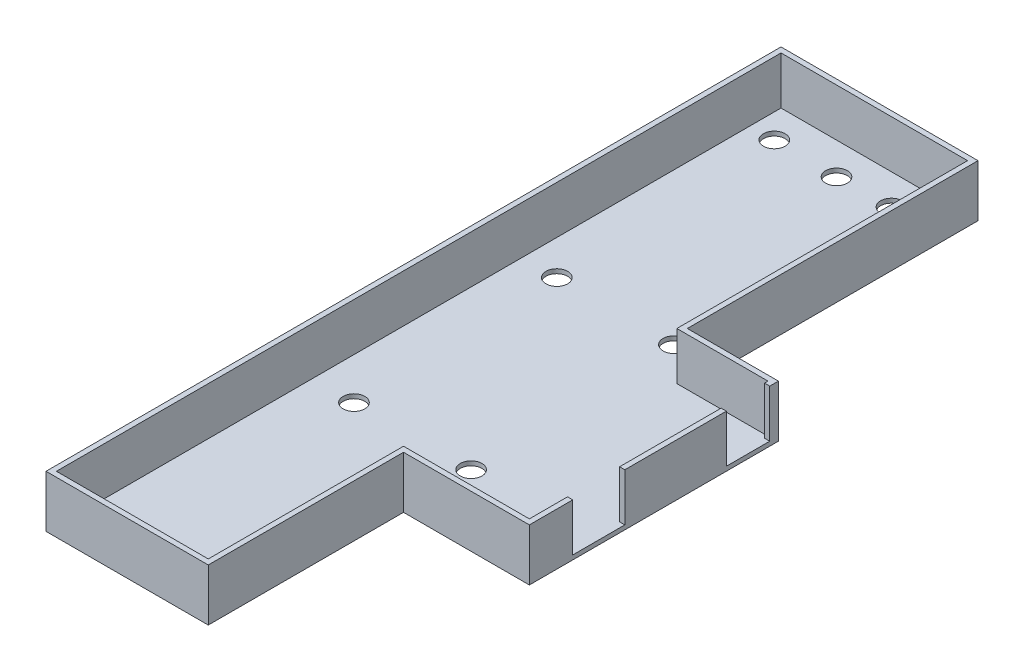
ISO-10303-21;
HEADER;
FILE_DESCRIPTION(('STEP AP214'),'2;1');
FILE_NAME('part.step','',(''),(''),'','','');
FILE_SCHEMA(('AUTOMOTIVE_DESIGN { 1 0 10303 214 1 1 1 1 }'));
ENDSEC;
DATA;
#1=APPLICATION_CONTEXT('core data for automotive mechanical design processes');
#2=APPLICATION_PROTOCOL_DEFINITION('international standard','automotive_design',2000,#1);
#3=PRODUCT_CONTEXT('',#1,'mechanical');
#4=PRODUCT('Part','Part','',(#3));
#5=PRODUCT_RELATED_PRODUCT_CATEGORY('part','',(#4));
#6=PRODUCT_DEFINITION_FORMATION('','',#4);
#7=PRODUCT_DEFINITION_CONTEXT('part definition',#1,'design');
#8=PRODUCT_DEFINITION('design','',#6,#7);
#9=PRODUCT_DEFINITION_SHAPE('','',#8);
#10=(LENGTH_UNIT() NAMED_UNIT(*) SI_UNIT(.MILLI.,.METRE.));
#11=(NAMED_UNIT(*) PLANE_ANGLE_UNIT() SI_UNIT($,.RADIAN.));
#12=(NAMED_UNIT(*) SI_UNIT($,.STERADIAN.) SOLID_ANGLE_UNIT());
#13=UNCERTAINTY_MEASURE_WITH_UNIT(LENGTH_MEASURE(1.E-05),#10,'distance_accuracy_value','');
#14=(GEOMETRIC_REPRESENTATION_CONTEXT(3) GLOBAL_UNCERTAINTY_ASSIGNED_CONTEXT((#13)) GLOBAL_UNIT_ASSIGNED_CONTEXT((#10,
#11,#12)) REPRESENTATION_CONTEXT('',''));
#15=CARTESIAN_POINT('',(0.,0.,0.));
#16=DIRECTION('',(0.,0.,1.));
#17=DIRECTION('',(1.,0.,0.));
#18=AXIS2_PLACEMENT_3D('',#15,#16,#17);
#19=CARTESIAN_POINT('',(64.,12.,67.));
#20=DIRECTION('',(-1.,0.,0.));
#21=DIRECTION('',(0.,0.,1.));
#22=AXIS2_PLACEMENT_3D('',#19,#20,#21);
#23=PLANE('',#22);
#24=DIRECTION('',(0.,1.,0.));
#25=VECTOR('',#24,1.);
#26=CARTESIAN_POINT('',(64.,12.,113.2));
#27=LINE('',#26,#25);
#28=CARTESIAN_POINT('',(64.,1.,113.2));
#29=VERTEX_POINT('',#28);
#30=CARTESIAN_POINT('',(64.,12.,113.2));
#31=VERTEX_POINT('',#30);
#32=EDGE_CURVE('E228',#29,#31,#27,.T.);
#33=ORIENTED_EDGE('',*,*,#32,.F.);
#34=DIRECTION('',(0.,0.,1.));
#35=VECTOR('',#34,1.);
#36=CARTESIAN_POINT('',(64.,1.,0.));
#37=LINE('',#36,#35);
#38=CARTESIAN_POINT('',(64.,1.,122.));
#39=VERTEX_POINT('',#38);
#40=EDGE_CURVE('E201',#29,#39,#37,.T.);
#41=ORIENTED_EDGE('',*,*,#40,.T.);
#42=DIRECTION('',(0.,-1.,0.));
#43=VECTOR('',#42,1.);
#44=CARTESIAN_POINT('',(64.,12.,122.));
#45=LINE('',#44,#43);
#46=CARTESIAN_POINT('',(64.,12.,122.));
#47=VERTEX_POINT('',#46);
#48=EDGE_CURVE('E280',#47,#39,#45,.T.);
#49=ORIENTED_EDGE('',*,*,#48,.F.);
#50=DIRECTION('',(0.,0.,-1.));
#51=VECTOR('',#50,1.);
#52=CARTESIAN_POINT('',(64.,12.,67.));
#53=LINE('',#52,#51);
#54=EDGE_CURVE('E262',#47,#31,#53,.T.);
#55=ORIENTED_EDGE('',*,*,#54,.T.);
#56=EDGE_LOOP('',(#33,#41,#49,#55));
#57=FACE_BOUND('',#56,.T.);
#58=ADVANCED_FACE('F35',(#57),#23,.T.);
#59=CARTESIAN_POINT('',(0.,12.,0.));
#60=DIRECTION('',(0.,-1.,0.));
#61=DIRECTION('',(0.,0.,-1.));
#62=AXIS2_PLACEMENT_3D('',#59,#60,#61);
#63=PLANE('',#62);
#64=DIRECTION('',(0.,0.,-1.));
#65=VECTOR('',#64,1.);
#66=CARTESIAN_POINT('',(65.2,12.,65.8));
#67=LINE('',#66,#65);
#68=CARTESIAN_POINT('',(65.2,12.,123.2));
#69=VERTEX_POINT('',#68);
#70=CARTESIAN_POINT('',(65.2,12.,113.2));
#71=VERTEX_POINT('',#70);
#72=EDGE_CURVE('E311',#69,#71,#67,.T.);
#73=ORIENTED_EDGE('',*,*,#72,.T.);
#74=DIRECTION('',(1.,0.,0.));
#75=VECTOR('',#74,1.);
#76=CARTESIAN_POINT('',(53.2,12.,113.2));
#77=LINE('',#76,#75);
#78=EDGE_CURVE('E210',#31,#71,#77,.T.);
#79=ORIENTED_EDGE('',*,*,#78,.F.);
#80=ORIENTED_EDGE('',*,*,#54,.F.);
#81=DIRECTION('',(1.,0.,0.));
#82=VECTOR('',#81,1.);
#83=CARTESIAN_POINT('',(64.,12.,122.));
#84=LINE('',#83,#82);
#85=CARTESIAN_POINT('',(35.,12.,122.));
#86=VERTEX_POINT('',#85);
#87=EDGE_CURVE('E259',#86,#47,#84,.T.);
#88=ORIENTED_EDGE('',*,*,#87,.F.);
#89=DIRECTION('',(0.,0.,-1.));
#90=VECTOR('',#89,1.);
#91=CARTESIAN_POINT('',(35.,12.,122.));
#92=LINE('',#91,#90);
#93=CARTESIAN_POINT('',(35.,12.,167.));
#94=VERTEX_POINT('',#93);
#95=EDGE_CURVE('E257',#94,#86,#92,.T.);
#96=ORIENTED_EDGE('',*,*,#95,.F.);
#97=DIRECTION('',(1.,0.,0.));
#98=VECTOR('',#97,1.);
#99=CARTESIAN_POINT('',(0.,12.,167.));
#100=LINE('',#99,#98);
#101=CARTESIAN_POINT('',(0.,12.,167.));
#102=VERTEX_POINT('',#101);
#103=EDGE_CURVE('E255',#102,#94,#100,.T.);
#104=ORIENTED_EDGE('',*,*,#103,.F.);
#105=DIRECTION('',(0.,0.,1.));
#106=VECTOR('',#105,1.);
#107=CARTESIAN_POINT('',(0.,12.,0.));
#108=LINE('',#107,#106);
#109=CARTESIAN_POINT('',(0.,12.,0.));
#110=VERTEX_POINT('',#109);
#111=EDGE_CURVE('E253',#110,#102,#108,.T.);
#112=ORIENTED_EDGE('',*,*,#111,.F.);
#113=DIRECTION('',(-1.,0.,0.));
#114=VECTOR('',#113,1.);
#115=CARTESIAN_POINT('',(0.,12.,0.));
#116=LINE('',#115,#114);
#117=CARTESIAN_POINT('',(43.,12.,0.));
#118=VERTEX_POINT('',#117);
#119=EDGE_CURVE('E251',#118,#110,#116,.T.);
#120=ORIENTED_EDGE('',*,*,#119,.F.);
#121=DIRECTION('',(0.,0.,-1.));
#122=VECTOR('',#121,1.);
#123=CARTESIAN_POINT('',(43.,12.,0.));
#124=LINE('',#123,#122);
#125=CARTESIAN_POINT('',(43.,12.,67.));
#126=VERTEX_POINT('',#125);
#127=EDGE_CURVE('E269',#126,#118,#124,.T.);
#128=ORIENTED_EDGE('',*,*,#127,.F.);
#129=DIRECTION('',(-1.,0.,0.));
#130=VECTOR('',#129,1.);
#131=CARTESIAN_POINT('',(43.,12.,67.));
#132=LINE('',#131,#130);
#133=CARTESIAN_POINT('',(64.,12.,67.));
#134=VERTEX_POINT('',#133);
#135=EDGE_CURVE('E265',#134,#126,#132,.T.);
#136=ORIENTED_EDGE('',*,*,#135,.F.);
#137=CARTESIAN_POINT('',(64.,12.,67.8));
#138=VERTEX_POINT('',#137);
#139=EDGE_CURVE('E261',#138,#134,#53,.T.);
#140=ORIENTED_EDGE('',*,*,#139,.F.);
#141=DIRECTION('',(1.,0.,0.));
#142=VECTOR('',#141,1.);
#143=CARTESIAN_POINT('',(53.2,12.,67.8));
#144=LINE('',#143,#142);
#145=CARTESIAN_POINT('',(65.2,12.,67.8));
#146=VERTEX_POINT('',#145);
#147=EDGE_CURVE('E242',#138,#146,#144,.T.);
#148=ORIENTED_EDGE('',*,*,#147,.T.);
#149=CARTESIAN_POINT('',(65.2,12.,65.8));
#150=VERTEX_POINT('',#149);
#151=EDGE_CURVE('E310',#146,#150,#67,.T.);
#152=ORIENTED_EDGE('',*,*,#151,.T.);
#153=DIRECTION('',(-1.,0.,0.));
#154=VECTOR('',#153,1.);
#155=CARTESIAN_POINT('',(44.2,12.,65.8));
#156=LINE('',#155,#154);
#157=CARTESIAN_POINT('',(44.2,12.,65.8));
#158=VERTEX_POINT('',#157);
#159=EDGE_CURVE('E313',#150,#158,#156,.T.);
#160=ORIENTED_EDGE('',*,*,#159,.T.);
#161=DIRECTION('',(0.,0.,-1.));
#162=VECTOR('',#161,1.);
#163=CARTESIAN_POINT('',(44.2,12.,-1.2));
#164=LINE('',#163,#162);
#165=CARTESIAN_POINT('',(44.2,12.,-1.2));
#166=VERTEX_POINT('',#165);
#167=EDGE_CURVE('E317',#158,#166,#164,.T.);
#168=ORIENTED_EDGE('',*,*,#167,.T.);
#169=DIRECTION('',(-1.,0.,0.));
#170=VECTOR('',#169,1.);
#171=CARTESIAN_POINT('',(-1.2,12.,-1.2));
#172=LINE('',#171,#170);
#173=CARTESIAN_POINT('',(-1.2,12.,-1.2));
#174=VERTEX_POINT('',#173);
#175=EDGE_CURVE('E295',#166,#174,#172,.T.);
#176=ORIENTED_EDGE('',*,*,#175,.T.);
#177=DIRECTION('',(0.,0.,1.));
#178=VECTOR('',#177,1.);
#179=CARTESIAN_POINT('',(-1.2,12.,-1.2));
#180=LINE('',#179,#178);
#181=CARTESIAN_POINT('',(-1.2,12.,168.2));
#182=VERTEX_POINT('',#181);
#183=EDGE_CURVE('E298',#174,#182,#180,.T.);
#184=ORIENTED_EDGE('',*,*,#183,.T.);
#185=DIRECTION('',(1.,0.,0.));
#186=VECTOR('',#185,1.);
#187=CARTESIAN_POINT('',(-1.2,12.,168.2));
#188=LINE('',#187,#186);
#189=CARTESIAN_POINT('',(36.2,12.,168.2));
#190=VERTEX_POINT('',#189);
#191=EDGE_CURVE('E301',#182,#190,#188,.T.);
#192=ORIENTED_EDGE('',*,*,#191,.T.);
#193=DIRECTION('',(0.,0.,-1.));
#194=VECTOR('',#193,1.);
#195=CARTESIAN_POINT('',(36.2,12.,123.2));
#196=LINE('',#195,#194);
#197=CARTESIAN_POINT('',(36.2,12.,123.2));
#198=VERTEX_POINT('',#197);
#199=EDGE_CURVE('E304',#190,#198,#196,.T.);
#200=ORIENTED_EDGE('',*,*,#199,.T.);
#201=DIRECTION('',(1.,0.,0.));
#202=VECTOR('',#201,1.);
#203=CARTESIAN_POINT('',(65.2,12.,123.2));
#204=LINE('',#203,#202);
#205=EDGE_CURVE('E307',#198,#69,#204,.T.);
#206=ORIENTED_EDGE('',*,*,#205,.T.);
#207=EDGE_LOOP('',(#73,#79,#80,#88,#96,#104,#112,#120,#128,#136,#140,#148,#152,#160,#168,#176,
#184,#192,#200,#206));
#208=FACE_BOUND('',#207,.T.);
#209=ADVANCED_FACE('F396',(#208),#63,.F.);
#210=DIRECTION('',(0.,-1.,0.));
#211=VECTOR('',#210,1.);
#212=CARTESIAN_POINT('',(64.,12.,101.2));
#213=LINE('',#212,#211);
#214=CARTESIAN_POINT('',(64.,12.,101.2));
#215=VERTEX_POINT('',#214);
#216=CARTESIAN_POINT('',(64.,1.,101.2));
#217=VERTEX_POINT('',#216);
#218=EDGE_CURVE('E223',#215,#217,#213,.T.);
#219=ORIENTED_EDGE('',*,*,#218,.F.);
#220=CARTESIAN_POINT('',(64.,12.,77.8));
#221=VERTEX_POINT('',#220);
#222=EDGE_CURVE('E266',#215,#221,#53,.T.);
#223=ORIENTED_EDGE('',*,*,#222,.T.);
#224=DIRECTION('',(0.,1.,0.));
#225=VECTOR('',#224,1.);
#226=CARTESIAN_POINT('',(64.,12.,77.8));
#227=LINE('',#226,#225);
#228=CARTESIAN_POINT('',(64.,1.,77.8));
#229=VERTEX_POINT('',#228);
#230=EDGE_CURVE('E248',#229,#221,#227,.T.);
#231=ORIENTED_EDGE('',*,*,#230,.F.);
#232=EDGE_CURVE('E330',#229,#217,#37,.T.);
#233=ORIENTED_EDGE('',*,*,#232,.T.);
#234=EDGE_LOOP('',(#219,#223,#231,#233));
#235=FACE_BOUND('',#234,.T.);
#236=ADVANCED_FACE('F451',(#235),#23,.T.);
#237=CARTESIAN_POINT('',(0.,1.,-1.2));
#238=DIRECTION('',(0.,0.,-1.));
#239=DIRECTION('',(-1.,0.,0.));
#240=AXIS2_PLACEMENT_3D('',#237,#238,#239);
#241=PLANE('',#240);
#242=DIRECTION('',(1.,0.,0.));
#243=VECTOR('',#242,1.);
#244=CARTESIAN_POINT('',(0.,0.,-1.2));
#245=LINE('',#244,#243);
#246=CARTESIAN_POINT('',(-1.2,0.,-1.2));
#247=VERTEX_POINT('',#246);
#248=CARTESIAN_POINT('',(44.2,0.,-1.2));
#249=VERTEX_POINT('',#248);
#250=EDGE_CURVE('E345',#247,#249,#245,.T.);
#251=ORIENTED_EDGE('',*,*,#250,.F.);
#252=DIRECTION('',(0.,-1.,0.));
#253=VECTOR('',#252,1.);
#254=CARTESIAN_POINT('',(-1.2,1.,-1.2));
#255=LINE('',#254,#253);
#256=EDGE_CURVE('E11',#174,#247,#255,.T.);
#257=ORIENTED_EDGE('',*,*,#256,.F.);
#258=ORIENTED_EDGE('',*,*,#175,.F.);
#259=DIRECTION('',(0.,-1.,0.));
#260=VECTOR('',#259,1.);
#261=CARTESIAN_POINT('',(44.2,1.,-1.2));
#262=LINE('',#261,#260);
#263=EDGE_CURVE('E368',#166,#249,#262,.T.);
#264=ORIENTED_EDGE('',*,*,#263,.T.);
#265=EDGE_LOOP('',(#251,#257,#258,#264));
#266=FACE_BOUND('',#265,.T.);
#267=ADVANCED_FACE('F37',(#266),#241,.T.);
#268=CARTESIAN_POINT('',(-1.2,1.,0.));
#269=DIRECTION('',(1.,0.,0.));
#270=DIRECTION('',(0.,0.,-1.));
#271=AXIS2_PLACEMENT_3D('',#268,#269,#270);
#272=PLANE('',#271);
#273=DIRECTION('',(0.,0.,1.));
#274=VECTOR('',#273,1.);
#275=CARTESIAN_POINT('',(-1.2,0.,0.));
#276=LINE('',#275,#274);
#277=CARTESIAN_POINT('',(-1.2,0.,168.2));
#278=VERTEX_POINT('',#277);
#279=EDGE_CURVE('E348',#247,#278,#276,.T.);
#280=ORIENTED_EDGE('',*,*,#279,.T.);
#281=DIRECTION('',(0.,-1.,0.));
#282=VECTOR('',#281,1.);
#283=CARTESIAN_POINT('',(-1.2,1.,168.2));
#284=LINE('',#283,#282);
#285=EDGE_CURVE('E43',#182,#278,#284,.T.);
#286=ORIENTED_EDGE('',*,*,#285,.F.);
#287=ORIENTED_EDGE('',*,*,#183,.F.);
#288=ORIENTED_EDGE('',*,*,#256,.T.);
#289=EDGE_LOOP('',(#280,#286,#287,#288));
#290=FACE_BOUND('',#289,.T.);
#291=ADVANCED_FACE('F399',(#290),#272,.F.);
#292=CARTESIAN_POINT('',(0.,1.,168.2));
#293=DIRECTION('',(0.,0.,-1.));
#294=DIRECTION('',(-1.,0.,0.));
#295=AXIS2_PLACEMENT_3D('',#292,#293,#294);
#296=PLANE('',#295);
#297=DIRECTION('',(1.,0.,0.));
#298=VECTOR('',#297,1.);
#299=CARTESIAN_POINT('',(0.,0.,168.2));
#300=LINE('',#299,#298);
#301=CARTESIAN_POINT('',(36.2,0.,168.2));
#302=VERTEX_POINT('',#301);
#303=EDGE_CURVE('E350',#278,#302,#300,.T.);
#304=ORIENTED_EDGE('',*,*,#303,.T.);
#305=DIRECTION('',(0.,-1.,0.));
#306=VECTOR('',#305,1.);
#307=CARTESIAN_POINT('',(36.2,1.,168.2));
#308=LINE('',#307,#306);
#309=EDGE_CURVE('E378',#190,#302,#308,.T.);
#310=ORIENTED_EDGE('',*,*,#309,.F.);
#311=ORIENTED_EDGE('',*,*,#191,.F.);
#312=ORIENTED_EDGE('',*,*,#285,.T.);
#313=EDGE_LOOP('',(#304,#310,#311,#312));
#314=FACE_BOUND('',#313,.T.);
#315=ADVANCED_FACE('F383',(#314),#296,.F.);
#316=CARTESIAN_POINT('',(36.2,1.,0.));
#317=DIRECTION('',(1.,0.,0.));
#318=DIRECTION('',(0.,0.,-1.));
#319=AXIS2_PLACEMENT_3D('',#316,#317,#318);
#320=PLANE('',#319);
#321=DIRECTION('',(0.,0.,1.));
#322=VECTOR('',#321,1.);
#323=CARTESIAN_POINT('',(36.2,0.,0.));
#324=LINE('',#323,#322);
#325=CARTESIAN_POINT('',(36.2,0.,123.2));
#326=VERTEX_POINT('',#325);
#327=EDGE_CURVE('E353',#326,#302,#324,.T.);
#328=ORIENTED_EDGE('',*,*,#327,.F.);
#329=DIRECTION('',(0.,-1.,0.));
#330=VECTOR('',#329,1.);
#331=CARTESIAN_POINT('',(36.2,1.,123.2));
#332=LINE('',#331,#330);
#333=EDGE_CURVE('E376',#198,#326,#332,.T.);
#334=ORIENTED_EDGE('',*,*,#333,.F.);
#335=ORIENTED_EDGE('',*,*,#199,.F.);
#336=ORIENTED_EDGE('',*,*,#309,.T.);
#337=EDGE_LOOP('',(#328,#334,#335,#336));
#338=FACE_BOUND('',#337,.T.);
#339=ADVANCED_FACE('F393',(#338),#320,.T.);
#340=CARTESIAN_POINT('',(0.,1.,123.2));
#341=DIRECTION('',(0.,0.,1.));
#342=DIRECTION('',(1.,0.,0.));
#343=AXIS2_PLACEMENT_3D('',#340,#341,#342);
#344=PLANE('',#343);
#345=DIRECTION('',(-1.,0.,0.));
#346=VECTOR('',#345,1.);
#347=CARTESIAN_POINT('',(0.,0.,123.2));
#348=LINE('',#347,#346);
#349=CARTESIAN_POINT('',(65.2,0.,123.2));
#350=VERTEX_POINT('',#349);
#351=EDGE_CURVE('E356',#350,#326,#348,.T.);
#352=ORIENTED_EDGE('',*,*,#351,.F.);
#353=DIRECTION('',(0.,-1.,0.));
#354=VECTOR('',#353,1.);
#355=CARTESIAN_POINT('',(65.2,1.,123.2));
#356=LINE('',#355,#354);
#357=EDGE_CURVE('E374',#69,#350,#356,.T.);
#358=ORIENTED_EDGE('',*,*,#357,.F.);
#359=ORIENTED_EDGE('',*,*,#205,.F.);
#360=ORIENTED_EDGE('',*,*,#333,.T.);
#361=EDGE_LOOP('',(#352,#358,#359,#360));
#362=FACE_BOUND('',#361,.T.);
#363=ADVANCED_FACE('F413',(#362),#344,.T.);
#364=CARTESIAN_POINT('',(65.2,1.,0.));
#365=DIRECTION('',(1.,0.,0.));
#366=DIRECTION('',(0.,0.,-1.));
#367=AXIS2_PLACEMENT_3D('',#364,#365,#366);
#368=PLANE('',#367);
#369=DIRECTION('',(0.,-1.,0.));
#370=VECTOR('',#369,1.);
#371=CARTESIAN_POINT('',(65.2,12.,113.2));
#372=LINE('',#371,#370);
#373=CARTESIAN_POINT('',(65.2,1.,113.2));
#374=VERTEX_POINT('',#373);
#375=EDGE_CURVE('E207',#71,#374,#372,.T.);
#376=ORIENTED_EDGE('',*,*,#375,.F.);
#377=ORIENTED_EDGE('',*,*,#72,.F.);
#378=ORIENTED_EDGE('',*,*,#357,.T.);
#379=DIRECTION('',(0.,0.,1.));
#380=VECTOR('',#379,1.);
#381=CARTESIAN_POINT('',(65.2,0.,0.));
#382=LINE('',#381,#380);
#383=CARTESIAN_POINT('',(65.2,0.,65.8));
#384=VERTEX_POINT('',#383);
#385=EDGE_CURVE('E359',#384,#350,#382,.T.);
#386=ORIENTED_EDGE('',*,*,#385,.F.);
#387=DIRECTION('',(0.,-1.,0.));
#388=VECTOR('',#387,1.);
#389=CARTESIAN_POINT('',(65.2,1.,65.8));
#390=LINE('',#389,#388);
#391=EDGE_CURVE('E372',#150,#384,#390,.T.);
#392=ORIENTED_EDGE('',*,*,#391,.F.);
#393=ORIENTED_EDGE('',*,*,#151,.F.);
#394=DIRECTION('',(0.,1.,0.));
#395=VECTOR('',#394,1.);
#396=CARTESIAN_POINT('',(65.2,12.,67.8));
#397=LINE('',#396,#395);
#398=CARTESIAN_POINT('',(65.2,1.,67.8));
#399=VERTEX_POINT('',#398);
#400=EDGE_CURVE('E235',#399,#146,#397,.T.);
#401=ORIENTED_EDGE('',*,*,#400,.F.);
#402=DIRECTION('',(0.,0.,-1.));
#403=VECTOR('',#402,1.);
#404=CARTESIAN_POINT('',(65.2,1.,77.8));
#405=LINE('',#404,#403);
#406=CARTESIAN_POINT('',(65.2,1.,77.8));
#407=VERTEX_POINT('',#406);
#408=EDGE_CURVE('E233',#407,#399,#405,.T.);
#409=ORIENTED_EDGE('',*,*,#408,.F.);
#410=DIRECTION('',(0.,-1.,0.));
#411=VECTOR('',#410,1.);
#412=CARTESIAN_POINT('',(65.2,12.,77.8));
#413=LINE('',#412,#411);
#414=CARTESIAN_POINT('',(65.2,12.,77.8));
#415=VERTEX_POINT('',#414);
#416=EDGE_CURVE('E230',#415,#407,#413,.T.);
#417=ORIENTED_EDGE('',*,*,#416,.F.);
#418=CARTESIAN_POINT('',(65.2,12.,101.2));
#419=VERTEX_POINT('',#418);
#420=EDGE_CURVE('E314',#419,#415,#67,.T.);
#421=ORIENTED_EDGE('',*,*,#420,.F.);
#422=DIRECTION('',(0.,1.,0.));
#423=VECTOR('',#422,1.);
#424=CARTESIAN_POINT('',(65.2,12.,101.2));
#425=LINE('',#424,#423);
#426=CARTESIAN_POINT('',(65.2,1.,101.2));
#427=VERTEX_POINT('',#426);
#428=EDGE_CURVE('E50',#427,#419,#425,.T.);
#429=ORIENTED_EDGE('',*,*,#428,.F.);
#430=DIRECTION('',(0.,0.,-1.));
#431=VECTOR('',#430,1.);
#432=CARTESIAN_POINT('',(65.2,1.,113.2));
#433=LINE('',#432,#431);
#434=EDGE_CURVE('E199',#374,#427,#433,.T.);
#435=ORIENTED_EDGE('',*,*,#434,.F.);
#436=EDGE_LOOP('',(#376,#377,#378,#386,#392,#393,#401,#409,#417,#421,#429,#435));
#437=FACE_BOUND('',#436,.T.);
#438=ADVANCED_FACE('F216',(#437),#368,.T.);
#439=CARTESIAN_POINT('',(0.,1.,65.8));
#440=DIRECTION('',(0.,0.,-1.));
#441=DIRECTION('',(-1.,0.,0.));
#442=AXIS2_PLACEMENT_3D('',#439,#440,#441);
#443=PLANE('',#442);
#444=DIRECTION('',(1.,0.,0.));
#445=VECTOR('',#444,1.);
#446=CARTESIAN_POINT('',(0.,0.,65.8));
#447=LINE('',#446,#445);
#448=CARTESIAN_POINT('',(44.2,0.,65.8));
#449=VERTEX_POINT('',#448);
#450=EDGE_CURVE('E362',#449,#384,#447,.T.);
#451=ORIENTED_EDGE('',*,*,#450,.F.);
#452=DIRECTION('',(0.,-1.,0.));
#453=VECTOR('',#452,1.);
#454=CARTESIAN_POINT('',(44.2,1.,65.8));
#455=LINE('',#454,#453);
#456=EDGE_CURVE('E370',#158,#449,#455,.T.);
#457=ORIENTED_EDGE('',*,*,#456,.F.);
#458=ORIENTED_EDGE('',*,*,#159,.F.);
#459=ORIENTED_EDGE('',*,*,#391,.T.);
#460=EDGE_LOOP('',(#451,#457,#458,#459));
#461=FACE_BOUND('',#460,.T.);
#462=ADVANCED_FACE('F408',(#461),#443,.T.);
#463=CARTESIAN_POINT('',(44.2,1.,0.));
#464=DIRECTION('',(1.,0.,0.));
#465=DIRECTION('',(0.,0.,-1.));
#466=AXIS2_PLACEMENT_3D('',#463,#464,#465);
#467=PLANE('',#466);
#468=DIRECTION('',(0.,0.,1.));
#469=VECTOR('',#468,1.);
#470=CARTESIAN_POINT('',(44.2,0.,0.));
#471=LINE('',#470,#469);
#472=EDGE_CURVE('E365',#249,#449,#471,.T.);
#473=ORIENTED_EDGE('',*,*,#472,.F.);
#474=ORIENTED_EDGE('',*,*,#263,.F.);
#475=ORIENTED_EDGE('',*,*,#167,.F.);
#476=ORIENTED_EDGE('',*,*,#456,.T.);
#477=EDGE_LOOP('',(#473,#474,#475,#476));
#478=FACE_BOUND('',#477,.T.);
#479=ADVANCED_FACE('F403',(#478),#467,.T.);
#480=CARTESIAN_POINT('',(0.,0.,0.));
#481=DIRECTION('',(0.,1.,0.));
#482=DIRECTION('',(0.,0.,1.));
#483=AXIS2_PLACEMENT_3D('',#480,#481,#482);
#484=PLANE('',#483);
#485=CARTESIAN_POINT('',(20.1394910329507,0.,7.35017085539014));
#486=DIRECTION('',(0.,1.,0.));
#487=DIRECTION('',(0.,0.,1.));
#488=AXIS2_PLACEMENT_3D('',#485,#486,#487);
#489=CIRCLE('',#488,2.5);
#490=CARTESIAN_POINT('',(20.1394910329507,0.,9.85017085539015));
#491=VERTEX_POINT('',#490);
#492=EDGE_CURVE('E790',#491,#491,#489,.T.);
#493=ORIENTED_EDGE('',*,*,#492,.T.);
#494=EDGE_LOOP('',(#493));
#495=FACE_BOUND('',#494,.T.);
#496=CARTESIAN_POINT('',(32.4886250144183,0.,7.036209821963));
#497=DIRECTION('',(0.,1.,0.));
#498=DIRECTION('',(0.,0.,1.));
#499=AXIS2_PLACEMENT_3D('',#496,#497,#498);
#500=CIRCLE('',#499,2.5);
#501=CARTESIAN_POINT('',(32.4886250144183,0.,9.536209821963));
#502=VERTEX_POINT('',#501);
#503=EDGE_CURVE('E792',#502,#502,#500,.T.);
#504=ORIENTED_EDGE('',*,*,#503,.T.);
#505=EDGE_LOOP('',(#504));
#506=FACE_BOUND('',#505,.T.);
#507=CARTESIAN_POINT('',(7.9996644071013,0.,59.6770097599137));
#508=DIRECTION('',(0.,1.,0.));
#509=DIRECTION('',(0.,0.,1.));
#510=AXIS2_PLACEMENT_3D('',#507,#508,#509);
#511=CIRCLE('',#510,2.5);
#512=CARTESIAN_POINT('',(7.9996644071013,0.,62.1770097599137));
#513=VERTEX_POINT('',#512);
#514=EDGE_CURVE('E797',#513,#513,#511,.T.);
#515=ORIENTED_EDGE('',*,*,#514,.T.);
#516=EDGE_LOOP('',(#515));
#517=FACE_BOUND('',#516,.T.);
#518=CARTESIAN_POINT('',(34.8956596040264,0.,59.5723560821046));
#519=DIRECTION('',(0.,1.,0.));
#520=DIRECTION('',(0.,0.,1.));
#521=AXIS2_PLACEMENT_3D('',#518,#519,#520);
#522=CIRCLE('',#521,2.5);
#523=CARTESIAN_POINT('',(34.8956596040264,0.,62.0723560821046));
#524=VERTEX_POINT('',#523);
#525=EDGE_CURVE('E806',#524,#524,#522,.T.);
#526=ORIENTED_EDGE('',*,*,#525,.T.);
#527=EDGE_LOOP('',(#526));
#528=FACE_BOUND('',#527,.T.);
#529=CARTESIAN_POINT('',(9.57939983412325,0.,108.003673303974));
#530=DIRECTION('',(0.,1.,0.));
#531=DIRECTION('',(0.,0.,1.));
#532=AXIS2_PLACEMENT_3D('',#529,#530,#531);
#533=CIRCLE('',#532,2.5);
#534=CARTESIAN_POINT('',(9.57939983412325,0.,110.503673303974));
#535=VERTEX_POINT('',#534);
#536=EDGE_CURVE('E809',#535,#535,#533,.T.);
#537=ORIENTED_EDGE('',*,*,#536,.T.);
#538=EDGE_LOOP('',(#537));
#539=FACE_BOUND('',#538,.T.);
#540=CARTESIAN_POINT('',(36.4753950310483,0.,107.899019626165));
#541=DIRECTION('',(0.,1.,0.));
#542=DIRECTION('',(0.,0.,1.));
#543=AXIS2_PLACEMENT_3D('',#540,#541,#542);
#544=CIRCLE('',#543,2.5);
#545=CARTESIAN_POINT('',(36.4753950310483,0.,110.399019626165));
#546=VERTEX_POINT('',#545);
#547=EDGE_CURVE('E812',#546,#546,#544,.T.);
#548=ORIENTED_EDGE('',*,*,#547,.T.);
#549=EDGE_LOOP('',(#548));
#550=FACE_BOUND('',#549,.T.);
#551=CARTESIAN_POINT('',(4.51154612226001,0.,160.279750326311));
#552=DIRECTION('',(0.,1.,0.));
#553=DIRECTION('',(0.,0.,1.));
#554=AXIS2_PLACEMENT_3D('',#551,#552,#553);
#555=CIRCLE('',#554,2.5);
#556=CARTESIAN_POINT('',(4.51154612226001,0.,162.779750326311));
#557=VERTEX_POINT('',#556);
#558=EDGE_CURVE('E815',#557,#557,#555,.T.);
#559=ORIENTED_EDGE('',*,*,#558,.T.);
#560=EDGE_LOOP('',(#559));
#561=FACE_BOUND('',#560,.T.);
#562=CARTESIAN_POINT('',(31.4075413191851,0.,160.175096648501));
#563=DIRECTION('',(0.,1.,0.));
#564=DIRECTION('',(0.,0.,1.));
#565=AXIS2_PLACEMENT_3D('',#562,#563,#564);
#566=CIRCLE('',#565,2.5);
#567=CARTESIAN_POINT('',(31.4075413191851,0.,162.675096648501));
#568=VERTEX_POINT('',#567);
#569=EDGE_CURVE('E818',#568,#568,#566,.T.);
#570=ORIENTED_EDGE('',*,*,#569,.T.);
#571=EDGE_LOOP('',(#570));
#572=FACE_BOUND('',#571,.T.);
#573=CARTESIAN_POINT('',(5.59262981749321,0.,7.14086349977205));
#574=DIRECTION('',(0.,1.,0.));
#575=DIRECTION('',(0.,0.,1.));
#576=AXIS2_PLACEMENT_3D('',#573,#574,#575);
#577=CIRCLE('',#576,2.5);
#578=CARTESIAN_POINT('',(5.59262981749321,0.,9.64086349977205));
#579=VERTEX_POINT('',#578);
#580=EDGE_CURVE('E214',#579,#579,#577,.T.);
#581=ORIENTED_EDGE('',*,*,#580,.T.);
#582=EDGE_LOOP('',(#581));
#583=FACE_BOUND('',#582,.T.);
#584=ORIENTED_EDGE('',*,*,#250,.T.);
#585=ORIENTED_EDGE('',*,*,#472,.T.);
#586=ORIENTED_EDGE('',*,*,#450,.T.);
#587=ORIENTED_EDGE('',*,*,#385,.T.);
#588=ORIENTED_EDGE('',*,*,#351,.T.);
#589=ORIENTED_EDGE('',*,*,#327,.T.);
#590=ORIENTED_EDGE('',*,*,#303,.F.);
#591=ORIENTED_EDGE('',*,*,#279,.F.);
#592=EDGE_LOOP('',(#584,#585,#586,#587,#588,#589,#590,#591));
#593=FACE_BOUND('',#592,.T.);
#594=ADVANCED_FACE('F388',(#495,#506,#517,#528,#539,#550,#561,#572,#583,#593),#484,.F.);
#595=ORIENTED_EDGE('',*,*,#222,.F.);
#596=DIRECTION('',(1.,0.,0.));
#597=VECTOR('',#596,1.);
#598=CARTESIAN_POINT('',(53.2,12.,101.2));
#599=LINE('',#598,#597);
#600=EDGE_CURVE('E224',#215,#419,#599,.T.);
#601=ORIENTED_EDGE('',*,*,#600,.T.);
#602=ORIENTED_EDGE('',*,*,#420,.T.);
#603=DIRECTION('',(1.,0.,0.));
#604=VECTOR('',#603,1.);
#605=CARTESIAN_POINT('',(53.2,12.,77.8));
#606=LINE('',#605,#604);
#607=EDGE_CURVE('E238',#221,#415,#606,.T.);
#608=ORIENTED_EDGE('',*,*,#607,.F.);
#609=EDGE_LOOP('',(#595,#601,#602,#608));
#610=FACE_BOUND('',#609,.T.);
#611=ADVANCED_FACE('F459',(#610),#63,.F.);
#612=CARTESIAN_POINT('',(0.,12.,0.));
#613=DIRECTION('',(0.,0.,1.));
#614=DIRECTION('',(1.,0.,0.));
#615=AXIS2_PLACEMENT_3D('',#612,#613,#614);
#616=PLANE('',#615);
#617=DIRECTION('',(0.,-1.,0.));
#618=VECTOR('',#617,1.);
#619=CARTESIAN_POINT('',(0.,12.,0.));
#620=LINE('',#619,#618);
#621=CARTESIAN_POINT('',(0.,1.,0.));
#622=VERTEX_POINT('',#621);
#623=EDGE_CURVE('E292',#110,#622,#620,.T.);
#624=ORIENTED_EDGE('',*,*,#623,.T.);
#625=DIRECTION('',(1.,0.,0.));
#626=VECTOR('',#625,1.);
#627=CARTESIAN_POINT('',(0.,1.,0.));
#628=LINE('',#627,#626);
#629=CARTESIAN_POINT('',(43.,1.,0.));
#630=VERTEX_POINT('',#629);
#631=EDGE_CURVE('E342',#622,#630,#628,.T.);
#632=ORIENTED_EDGE('',*,*,#631,.T.);
#633=DIRECTION('',(0.,-1.,0.));
#634=VECTOR('',#633,1.);
#635=CARTESIAN_POINT('',(43.,12.,0.));
#636=LINE('',#635,#634);
#637=EDGE_CURVE('E271',#118,#630,#636,.T.);
#638=ORIENTED_EDGE('',*,*,#637,.F.);
#639=ORIENTED_EDGE('',*,*,#119,.T.);
#640=EDGE_LOOP('',(#624,#632,#638,#639));
#641=FACE_BOUND('',#640,.T.);
#642=ADVANCED_FACE('F438',(#641),#616,.T.);
#643=CARTESIAN_POINT('',(0.,12.,0.));
#644=DIRECTION('',(1.,0.,0.));
#645=DIRECTION('',(0.,0.,-1.));
#646=AXIS2_PLACEMENT_3D('',#643,#644,#645);
#647=PLANE('',#646);
#648=DIRECTION('',(0.,-1.,0.));
#649=VECTOR('',#648,1.);
#650=CARTESIAN_POINT('',(0.,12.,167.));
#651=LINE('',#650,#649);
#652=CARTESIAN_POINT('',(0.,1.,167.));
#653=VERTEX_POINT('',#652);
#654=EDGE_CURVE('E289',#102,#653,#651,.T.);
#655=ORIENTED_EDGE('',*,*,#654,.T.);
#656=DIRECTION('',(0.,0.,-1.));
#657=VECTOR('',#656,1.);
#658=CARTESIAN_POINT('',(0.,1.,0.));
#659=LINE('',#658,#657);
#660=EDGE_CURVE('E339',#653,#622,#659,.T.);
#661=ORIENTED_EDGE('',*,*,#660,.T.);
#662=ORIENTED_EDGE('',*,*,#623,.F.);
#663=ORIENTED_EDGE('',*,*,#111,.T.);
#664=EDGE_LOOP('',(#655,#661,#662,#663));
#665=FACE_BOUND('',#664,.T.);
#666=ADVANCED_FACE('F431',(#665),#647,.T.);
#667=CARTESIAN_POINT('',(0.,12.,167.));
#668=DIRECTION('',(0.,0.,-1.));
#669=DIRECTION('',(-1.,0.,0.));
#670=AXIS2_PLACEMENT_3D('',#667,#668,#669);
#671=PLANE('',#670);
#672=DIRECTION('',(0.,-1.,0.));
#673=VECTOR('',#672,1.);
#674=CARTESIAN_POINT('',(35.,12.,167.));
#675=LINE('',#674,#673);
#676=CARTESIAN_POINT('',(35.,1.,167.));
#677=VERTEX_POINT('',#676);
#678=EDGE_CURVE('E286',#94,#677,#675,.T.);
#679=ORIENTED_EDGE('',*,*,#678,.T.);
#680=DIRECTION('',(-1.,0.,0.));
#681=VECTOR('',#680,1.);
#682=CARTESIAN_POINT('',(0.,1.,167.));
#683=LINE('',#682,#681);
#684=EDGE_CURVE('E336',#677,#653,#683,.T.);
#685=ORIENTED_EDGE('',*,*,#684,.T.);
#686=ORIENTED_EDGE('',*,*,#654,.F.);
#687=ORIENTED_EDGE('',*,*,#103,.T.);
#688=EDGE_LOOP('',(#679,#685,#686,#687));
#689=FACE_BOUND('',#688,.T.);
#690=ADVANCED_FACE('F428',(#689),#671,.T.);
#691=CARTESIAN_POINT('',(35.,12.,122.));
#692=DIRECTION('',(-1.,0.,0.));
#693=DIRECTION('',(0.,0.,1.));
#694=AXIS2_PLACEMENT_3D('',#691,#692,#693);
#695=PLANE('',#694);
#696=DIRECTION('',(0.,-1.,0.));
#697=VECTOR('',#696,1.);
#698=CARTESIAN_POINT('',(35.,12.,122.));
#699=LINE('',#698,#697);
#700=CARTESIAN_POINT('',(35.,1.,122.));
#701=VERTEX_POINT('',#700);
#702=EDGE_CURVE('E283',#86,#701,#699,.T.);
#703=ORIENTED_EDGE('',*,*,#702,.T.);
#704=DIRECTION('',(0.,0.,1.));
#705=VECTOR('',#704,1.);
#706=CARTESIAN_POINT('',(35.,1.,0.));
#707=LINE('',#706,#705);
#708=EDGE_CURVE('E333',#701,#677,#707,.T.);
#709=ORIENTED_EDGE('',*,*,#708,.T.);
#710=ORIENTED_EDGE('',*,*,#678,.F.);
#711=ORIENTED_EDGE('',*,*,#95,.T.);
#712=EDGE_LOOP('',(#703,#709,#710,#711));
#713=FACE_BOUND('',#712,.T.);
#714=ADVANCED_FACE('F426',(#713),#695,.T.);
#715=CARTESIAN_POINT('',(64.,12.,122.));
#716=DIRECTION('',(0.,0.,-1.));
#717=DIRECTION('',(-1.,0.,0.));
#718=AXIS2_PLACEMENT_3D('',#715,#716,#717);
#719=PLANE('',#718);
#720=ORIENTED_EDGE('',*,*,#48,.T.);
#721=DIRECTION('',(-1.,0.,0.));
#722=VECTOR('',#721,1.);
#723=CARTESIAN_POINT('',(0.,1.,122.));
#724=LINE('',#723,#722);
#725=EDGE_CURVE('E329',#39,#701,#724,.T.);
#726=ORIENTED_EDGE('',*,*,#725,.T.);
#727=ORIENTED_EDGE('',*,*,#702,.F.);
#728=ORIENTED_EDGE('',*,*,#87,.T.);
#729=EDGE_LOOP('',(#720,#726,#727,#728));
#730=FACE_BOUND('',#729,.T.);
#731=ADVANCED_FACE('F419',(#730),#719,.T.);
#732=DIRECTION('',(0.,-1.,0.));
#733=VECTOR('',#732,1.);
#734=CARTESIAN_POINT('',(64.,12.,67.8));
#735=LINE('',#734,#733);
#736=CARTESIAN_POINT('',(64.,1.,67.8));
#737=VERTEX_POINT('',#736);
#738=EDGE_CURVE('E241',#138,#737,#735,.T.);
#739=ORIENTED_EDGE('',*,*,#738,.F.);
#740=ORIENTED_EDGE('',*,*,#139,.T.);
#741=DIRECTION('',(0.,-1.,0.));
#742=VECTOR('',#741,1.);
#743=CARTESIAN_POINT('',(64.,12.,67.));
#744=LINE('',#743,#742);
#745=CARTESIAN_POINT('',(64.,1.,67.));
#746=VERTEX_POINT('',#745);
#747=EDGE_CURVE('E277',#134,#746,#744,.T.);
#748=ORIENTED_EDGE('',*,*,#747,.T.);
#749=EDGE_CURVE('E326',#746,#737,#37,.T.);
#750=ORIENTED_EDGE('',*,*,#749,.T.);
#751=EDGE_LOOP('',(#739,#740,#748,#750));
#752=FACE_BOUND('',#751,.T.);
#753=ADVANCED_FACE('F478',(#752),#23,.T.);
#754=CARTESIAN_POINT('',(43.,12.,67.));
#755=DIRECTION('',(0.,0.,1.));
#756=DIRECTION('',(1.,0.,0.));
#757=AXIS2_PLACEMENT_3D('',#754,#755,#756);
#758=PLANE('',#757);
#759=DIRECTION('',(0.,-1.,0.));
#760=VECTOR('',#759,1.);
#761=CARTESIAN_POINT('',(43.,12.,67.));
#762=LINE('',#761,#760);
#763=CARTESIAN_POINT('',(43.,1.,67.));
#764=VERTEX_POINT('',#763);
#765=EDGE_CURVE('E274',#126,#764,#762,.T.);
#766=ORIENTED_EDGE('',*,*,#765,.T.);
#767=DIRECTION('',(1.,0.,0.));
#768=VECTOR('',#767,1.);
#769=CARTESIAN_POINT('',(0.,1.,67.));
#770=LINE('',#769,#768);
#771=EDGE_CURVE('E323',#764,#746,#770,.T.);
#772=ORIENTED_EDGE('',*,*,#771,.T.);
#773=ORIENTED_EDGE('',*,*,#747,.F.);
#774=ORIENTED_EDGE('',*,*,#135,.T.);
#775=EDGE_LOOP('',(#766,#772,#773,#774));
#776=FACE_BOUND('',#775,.T.);
#777=ADVANCED_FACE('F443',(#776),#758,.T.);
#778=CARTESIAN_POINT('',(43.,12.,0.));
#779=DIRECTION('',(-1.,0.,0.));
#780=DIRECTION('',(0.,0.,1.));
#781=AXIS2_PLACEMENT_3D('',#778,#779,#780);
#782=PLANE('',#781);
#783=ORIENTED_EDGE('',*,*,#637,.T.);
#784=DIRECTION('',(0.,0.,1.));
#785=VECTOR('',#784,1.);
#786=CARTESIAN_POINT('',(43.,1.,0.));
#787=LINE('',#786,#785);
#788=EDGE_CURVE('E320',#630,#764,#787,.T.);
#789=ORIENTED_EDGE('',*,*,#788,.T.);
#790=ORIENTED_EDGE('',*,*,#765,.F.);
#791=ORIENTED_EDGE('',*,*,#127,.T.);
#792=EDGE_LOOP('',(#783,#789,#790,#791));
#793=FACE_BOUND('',#792,.T.);
#794=ADVANCED_FACE('F440',(#793),#782,.T.);
#795=CARTESIAN_POINT('',(0.,1.,0.));
#796=DIRECTION('',(0.,1.,0.));
#797=DIRECTION('',(0.,0.,1.));
#798=AXIS2_PLACEMENT_3D('',#795,#796,#797);
#799=PLANE('',#798);
#800=CARTESIAN_POINT('',(20.1394910329507,1.,7.35017085539014));
#801=DIRECTION('',(0.,1.,0.));
#802=DIRECTION('',(0.,0.,1.));
#803=AXIS2_PLACEMENT_3D('',#800,#801,#802);
#804=CIRCLE('',#803,2.5);
#805=CARTESIAN_POINT('',(20.1394910329507,1.,9.85017085539015));
#806=VERTEX_POINT('',#805);
#807=EDGE_CURVE('E787',#806,#806,#804,.T.);
#808=ORIENTED_EDGE('',*,*,#807,.F.);
#809=EDGE_LOOP('',(#808));
#810=FACE_BOUND('',#809,.T.);
#811=CARTESIAN_POINT('',(32.4886250144183,1.,7.036209821963));
#812=DIRECTION('',(0.,1.,0.));
#813=DIRECTION('',(0.,0.,1.));
#814=AXIS2_PLACEMENT_3D('',#811,#812,#813);
#815=CIRCLE('',#814,2.5);
#816=CARTESIAN_POINT('',(32.4886250144183,1.,9.536209821963));
#817=VERTEX_POINT('',#816);
#818=EDGE_CURVE('E839',#817,#817,#815,.T.);
#819=ORIENTED_EDGE('',*,*,#818,.F.);
#820=EDGE_LOOP('',(#819));
#821=FACE_BOUND('',#820,.T.);
#822=CARTESIAN_POINT('',(7.9996644071013,1.,59.6770097599137));
#823=DIRECTION('',(0.,1.,0.));
#824=DIRECTION('',(0.,0.,1.));
#825=AXIS2_PLACEMENT_3D('',#822,#823,#824);
#826=CIRCLE('',#825,2.5);
#827=CARTESIAN_POINT('',(7.9996644071013,1.,62.1770097599137));
#828=VERTEX_POINT('',#827);
#829=EDGE_CURVE('E836',#828,#828,#826,.T.);
#830=ORIENTED_EDGE('',*,*,#829,.F.);
#831=EDGE_LOOP('',(#830));
#832=FACE_BOUND('',#831,.T.);
#833=CARTESIAN_POINT('',(34.8956596040264,1.,59.5723560821046));
#834=DIRECTION('',(0.,1.,0.));
#835=DIRECTION('',(0.,0.,1.));
#836=AXIS2_PLACEMENT_3D('',#833,#834,#835);
#837=CIRCLE('',#836,2.5);
#838=CARTESIAN_POINT('',(34.8956596040264,1.,62.0723560821046));
#839=VERTEX_POINT('',#838);
#840=EDGE_CURVE('E833',#839,#839,#837,.T.);
#841=ORIENTED_EDGE('',*,*,#840,.F.);
#842=EDGE_LOOP('',(#841));
#843=FACE_BOUND('',#842,.T.);
#844=CARTESIAN_POINT('',(9.57939983412325,1.,108.003673303974));
#845=DIRECTION('',(0.,1.,0.));
#846=DIRECTION('',(0.,0.,1.));
#847=AXIS2_PLACEMENT_3D('',#844,#845,#846);
#848=CIRCLE('',#847,2.5);
#849=CARTESIAN_POINT('',(9.57939983412325,1.,110.503673303974));
#850=VERTEX_POINT('',#849);
#851=EDGE_CURVE('E830',#850,#850,#848,.T.);
#852=ORIENTED_EDGE('',*,*,#851,.F.);
#853=EDGE_LOOP('',(#852));
#854=FACE_BOUND('',#853,.T.);
#855=CARTESIAN_POINT('',(36.4753950310483,1.,107.899019626165));
#856=DIRECTION('',(0.,1.,0.));
#857=DIRECTION('',(0.,0.,1.));
#858=AXIS2_PLACEMENT_3D('',#855,#856,#857);
#859=CIRCLE('',#858,2.5);
#860=CARTESIAN_POINT('',(36.4753950310483,1.,110.399019626165));
#861=VERTEX_POINT('',#860);
#862=EDGE_CURVE('E827',#861,#861,#859,.T.);
#863=ORIENTED_EDGE('',*,*,#862,.F.);
#864=EDGE_LOOP('',(#863));
#865=FACE_BOUND('',#864,.T.);
#866=CARTESIAN_POINT('',(4.51154612226001,1.,160.279750326311));
#867=DIRECTION('',(0.,1.,0.));
#868=DIRECTION('',(0.,0.,1.));
#869=AXIS2_PLACEMENT_3D('',#866,#867,#868);
#870=CIRCLE('',#869,2.5);
#871=CARTESIAN_POINT('',(4.51154612226001,1.,162.779750326311));
#872=VERTEX_POINT('',#871);
#873=EDGE_CURVE('E824',#872,#872,#870,.T.);
#874=ORIENTED_EDGE('',*,*,#873,.F.);
#875=EDGE_LOOP('',(#874));
#876=FACE_BOUND('',#875,.T.);
#877=CARTESIAN_POINT('',(31.4075413191851,1.,160.175096648501));
#878=DIRECTION('',(0.,1.,0.));
#879=DIRECTION('',(0.,0.,1.));
#880=AXIS2_PLACEMENT_3D('',#877,#878,#879);
#881=CIRCLE('',#880,2.5);
#882=CARTESIAN_POINT('',(31.4075413191851,1.,162.675096648501));
#883=VERTEX_POINT('',#882);
#884=EDGE_CURVE('E821',#883,#883,#881,.T.);
#885=ORIENTED_EDGE('',*,*,#884,.F.);
#886=EDGE_LOOP('',(#885));
#887=FACE_BOUND('',#886,.T.);
#888=CARTESIAN_POINT('',(5.59262981749321,1.,7.14086349977205));
#889=DIRECTION('',(0.,1.,0.));
#890=DIRECTION('',(0.,0.,1.));
#891=AXIS2_PLACEMENT_3D('',#888,#889,#890);
#892=CIRCLE('',#891,2.5);
#893=CARTESIAN_POINT('',(5.59262981749321,1.,9.64086349977205));
#894=VERTEX_POINT('',#893);
#895=EDGE_CURVE('E791',#894,#894,#892,.T.);
#896=ORIENTED_EDGE('',*,*,#895,.F.);
#897=EDGE_LOOP('',(#896));
#898=FACE_BOUND('',#897,.T.);
#899=ORIENTED_EDGE('',*,*,#40,.F.);
#900=DIRECTION('',(1.,0.,0.));
#901=VECTOR('',#900,1.);
#902=CARTESIAN_POINT('',(53.2,1.,113.2));
#903=LINE('',#902,#901);
#904=EDGE_CURVE('E194',#29,#374,#903,.T.);
#905=ORIENTED_EDGE('',*,*,#904,.T.);
#906=ORIENTED_EDGE('',*,*,#434,.T.);
#907=DIRECTION('',(1.,0.,0.));
#908=VECTOR('',#907,1.);
#909=CARTESIAN_POINT('',(53.2,1.,101.2));
#910=LINE('',#909,#908);
#911=EDGE_CURVE('E204',#217,#427,#910,.T.);
#912=ORIENTED_EDGE('',*,*,#911,.F.);
#913=ORIENTED_EDGE('',*,*,#232,.F.);
#914=DIRECTION('',(1.,0.,0.));
#915=VECTOR('',#914,1.);
#916=CARTESIAN_POINT('',(53.2,1.,77.8));
#917=LINE('',#916,#915);
#918=EDGE_CURVE('E237',#229,#407,#917,.T.);
#919=ORIENTED_EDGE('',*,*,#918,.T.);
#920=ORIENTED_EDGE('',*,*,#408,.T.);
#921=DIRECTION('',(1.,0.,0.));
#922=VECTOR('',#921,1.);
#923=CARTESIAN_POINT('',(53.2,1.,67.8));
#924=LINE('',#923,#922);
#925=EDGE_CURVE('E58',#737,#399,#924,.T.);
#926=ORIENTED_EDGE('',*,*,#925,.F.);
#927=ORIENTED_EDGE('',*,*,#749,.F.);
#928=ORIENTED_EDGE('',*,*,#771,.F.);
#929=ORIENTED_EDGE('',*,*,#788,.F.);
#930=ORIENTED_EDGE('',*,*,#631,.F.);
#931=ORIENTED_EDGE('',*,*,#660,.F.);
#932=ORIENTED_EDGE('',*,*,#684,.F.);
#933=ORIENTED_EDGE('',*,*,#708,.F.);
#934=ORIENTED_EDGE('',*,*,#725,.F.);
#935=EDGE_LOOP('',(#899,#905,#906,#912,#913,#919,#920,#926,#927,#928,#929,#930,#931,#932,#933,#934));
#936=FACE_BOUND('',#935,.T.);
#937=ADVANCED_FACE('F196',(#810,#821,#832,#843,#854,#865,#876,#887,#898,#936),#799,.T.);
#938=CARTESIAN_POINT('',(53.2,12.,77.8));
#939=DIRECTION('',(0.,0.,1.));
#940=DIRECTION('',(1.,0.,0.));
#941=AXIS2_PLACEMENT_3D('',#938,#939,#940);
#942=PLANE('',#941);
#943=ORIENTED_EDGE('',*,*,#230,.T.);
#944=ORIENTED_EDGE('',*,*,#607,.T.);
#945=ORIENTED_EDGE('',*,*,#416,.T.);
#946=ORIENTED_EDGE('',*,*,#918,.F.);
#947=EDGE_LOOP('',(#943,#944,#945,#946));
#948=FACE_BOUND('',#947,.T.);
#949=ADVANCED_FACE('F457',(#948),#942,.F.);
#950=CARTESIAN_POINT('',(53.2,12.,67.8));
#951=DIRECTION('',(0.,0.,-1.));
#952=DIRECTION('',(-1.,0.,0.));
#953=AXIS2_PLACEMENT_3D('',#950,#951,#952);
#954=PLANE('',#953);
#955=ORIENTED_EDGE('',*,*,#738,.T.);
#956=ORIENTED_EDGE('',*,*,#925,.T.);
#957=ORIENTED_EDGE('',*,*,#400,.T.);
#958=ORIENTED_EDGE('',*,*,#147,.F.);
#959=EDGE_LOOP('',(#955,#956,#957,#958));
#960=FACE_BOUND('',#959,.T.);
#961=ADVANCED_FACE('F463',(#960),#954,.F.);
#962=CARTESIAN_POINT('',(53.2,12.,113.2));
#963=DIRECTION('',(0.,0.,1.));
#964=DIRECTION('',(1.,0.,0.));
#965=AXIS2_PLACEMENT_3D('',#962,#963,#964);
#966=PLANE('',#965);
#967=ORIENTED_EDGE('',*,*,#32,.T.);
#968=ORIENTED_EDGE('',*,*,#78,.T.);
#969=ORIENTED_EDGE('',*,*,#375,.T.);
#970=ORIENTED_EDGE('',*,*,#904,.F.);
#971=EDGE_LOOP('',(#967,#968,#969,#970));
#972=FACE_BOUND('',#971,.T.);
#973=ADVANCED_FACE('F208',(#972),#966,.F.);
#974=CARTESIAN_POINT('',(53.2,12.,101.2));
#975=DIRECTION('',(0.,0.,-1.));
#976=DIRECTION('',(-1.,0.,0.));
#977=AXIS2_PLACEMENT_3D('',#974,#975,#976);
#978=PLANE('',#977);
#979=ORIENTED_EDGE('',*,*,#218,.T.);
#980=ORIENTED_EDGE('',*,*,#911,.T.);
#981=ORIENTED_EDGE('',*,*,#428,.T.);
#982=ORIENTED_EDGE('',*,*,#600,.F.);
#983=EDGE_LOOP('',(#979,#980,#981,#982));
#984=FACE_BOUND('',#983,.T.);
#985=ADVANCED_FACE('F464',(#984),#978,.F.);
#986=CARTESIAN_POINT('',(5.59262981749321,-11.,7.14086349977205));
#987=DIRECTION('',(0.,1.,0.));
#988=DIRECTION('',(0.,0.,1.));
#989=AXIS2_PLACEMENT_3D('',#986,#987,#988);
#990=CYLINDRICAL_SURFACE('',#989,2.5);
#991=ORIENTED_EDGE('',*,*,#895,.T.);
#992=EDGE_LOOP('',(#991));
#993=FACE_BOUND('',#992,.T.);
#994=ORIENTED_EDGE('',*,*,#580,.F.);
#995=EDGE_LOOP('',(#994));
#996=FACE_BOUND('',#995,.T.);
#997=ADVANCED_FACE('F466',(#993,#996),#990,.F.);
#998=CARTESIAN_POINT('',(31.4075413191851,-11.,160.175096648501));
#999=DIRECTION('',(0.,1.,0.));
#1000=DIRECTION('',(0.,0.,1.));
#1001=AXIS2_PLACEMENT_3D('',#998,#999,#1000);
#1002=CYLINDRICAL_SURFACE('',#1001,2.5);
#1003=ORIENTED_EDGE('',*,*,#884,.T.);
#1004=EDGE_LOOP('',(#1003));
#1005=FACE_BOUND('',#1004,.T.);
#1006=ORIENTED_EDGE('',*,*,#569,.F.);
#1007=EDGE_LOOP('',(#1006));
#1008=FACE_BOUND('',#1007,.T.);
#1009=ADVANCED_FACE('F472',(#1005,#1008),#1002,.F.);
#1010=CARTESIAN_POINT('',(4.51154612226001,-11.,160.279750326311));
#1011=DIRECTION('',(0.,1.,0.));
#1012=DIRECTION('',(0.,0.,1.));
#1013=AXIS2_PLACEMENT_3D('',#1010,#1011,#1012);
#1014=CYLINDRICAL_SURFACE('',#1013,2.5);
#1015=ORIENTED_EDGE('',*,*,#873,.T.);
#1016=EDGE_LOOP('',(#1015));
#1017=FACE_BOUND('',#1016,.T.);
#1018=ORIENTED_EDGE('',*,*,#558,.F.);
#1019=EDGE_LOOP('',(#1018));
#1020=FACE_BOUND('',#1019,.T.);
#1021=ADVANCED_FACE('F710',(#1017,#1020),#1014,.F.);
#1022=CARTESIAN_POINT('',(36.4753950310483,-11.,107.899019626165));
#1023=DIRECTION('',(0.,1.,0.));
#1024=DIRECTION('',(0.,0.,1.));
#1025=AXIS2_PLACEMENT_3D('',#1022,#1023,#1024);
#1026=CYLINDRICAL_SURFACE('',#1025,2.5);
#1027=ORIENTED_EDGE('',*,*,#862,.T.);
#1028=EDGE_LOOP('',(#1027));
#1029=FACE_BOUND('',#1028,.T.);
#1030=ORIENTED_EDGE('',*,*,#547,.F.);
#1031=EDGE_LOOP('',(#1030));
#1032=FACE_BOUND('',#1031,.T.);
#1033=ADVANCED_FACE('F719',(#1029,#1032),#1026,.F.);
#1034=CARTESIAN_POINT('',(9.57939983412325,-11.,108.003673303974));
#1035=DIRECTION('',(0.,1.,0.));
#1036=DIRECTION('',(0.,0.,1.));
#1037=AXIS2_PLACEMENT_3D('',#1034,#1035,#1036);
#1038=CYLINDRICAL_SURFACE('',#1037,2.5);
#1039=ORIENTED_EDGE('',*,*,#851,.T.);
#1040=EDGE_LOOP('',(#1039));
#1041=FACE_BOUND('',#1040,.T.);
#1042=ORIENTED_EDGE('',*,*,#536,.F.);
#1043=EDGE_LOOP('',(#1042));
#1044=FACE_BOUND('',#1043,.T.);
#1045=ADVANCED_FACE('F728',(#1041,#1044),#1038,.F.);
#1046=CARTESIAN_POINT('',(34.8956596040264,-11.,59.5723560821046));
#1047=DIRECTION('',(0.,1.,0.));
#1048=DIRECTION('',(0.,0.,1.));
#1049=AXIS2_PLACEMENT_3D('',#1046,#1047,#1048);
#1050=CYLINDRICAL_SURFACE('',#1049,2.5);
#1051=ORIENTED_EDGE('',*,*,#840,.T.);
#1052=EDGE_LOOP('',(#1051));
#1053=FACE_BOUND('',#1052,.T.);
#1054=ORIENTED_EDGE('',*,*,#525,.F.);
#1055=EDGE_LOOP('',(#1054));
#1056=FACE_BOUND('',#1055,.T.);
#1057=ADVANCED_FACE('F737',(#1053,#1056),#1050,.F.);
#1058=CARTESIAN_POINT('',(7.9996644071013,-11.,59.6770097599137));
#1059=DIRECTION('',(0.,1.,0.));
#1060=DIRECTION('',(0.,0.,1.));
#1061=AXIS2_PLACEMENT_3D('',#1058,#1059,#1060);
#1062=CYLINDRICAL_SURFACE('',#1061,2.5);
#1063=ORIENTED_EDGE('',*,*,#829,.T.);
#1064=EDGE_LOOP('',(#1063));
#1065=FACE_BOUND('',#1064,.T.);
#1066=ORIENTED_EDGE('',*,*,#514,.F.);
#1067=EDGE_LOOP('',(#1066));
#1068=FACE_BOUND('',#1067,.T.);
#1069=ADVANCED_FACE('F746',(#1065,#1068),#1062,.F.);
#1070=CARTESIAN_POINT('',(32.4886250144183,-11.,7.036209821963));
#1071=DIRECTION('',(0.,1.,0.));
#1072=DIRECTION('',(0.,0.,1.));
#1073=AXIS2_PLACEMENT_3D('',#1070,#1071,#1072);
#1074=CYLINDRICAL_SURFACE('',#1073,2.5);
#1075=ORIENTED_EDGE('',*,*,#818,.T.);
#1076=EDGE_LOOP('',(#1075));
#1077=FACE_BOUND('',#1076,.T.);
#1078=ORIENTED_EDGE('',*,*,#503,.F.);
#1079=EDGE_LOOP('',(#1078));
#1080=FACE_BOUND('',#1079,.T.);
#1081=ADVANCED_FACE('F755',(#1077,#1080),#1074,.F.);
#1082=CARTESIAN_POINT('',(20.1394910329507,-11.,7.35017085539014));
#1083=DIRECTION('',(0.,1.,0.));
#1084=DIRECTION('',(0.,0.,1.));
#1085=AXIS2_PLACEMENT_3D('',#1082,#1083,#1084);
#1086=CYLINDRICAL_SURFACE('',#1085,2.5);
#1087=ORIENTED_EDGE('',*,*,#807,.T.);
#1088=EDGE_LOOP('',(#1087));
#1089=FACE_BOUND('',#1088,.T.);
#1090=ORIENTED_EDGE('',*,*,#492,.F.);
#1091=EDGE_LOOP('',(#1090));
#1092=FACE_BOUND('',#1091,.T.);
#1093=ADVANCED_FACE('F764',(#1089,#1092),#1086,.F.);
#1094=CLOSED_SHELL('',(#58,#209,#236,#267,#291,#315,#339,#363,#438,#462,#479,#594,#611,#642,
#666,#690,#714,#731,#753,#777,#794,#937,#949,#961,#973,#985,#997,#1009,#1021,#1033,#1045,#1057,
#1069,#1081,#1093));
#1095=MANIFOLD_SOLID_BREP('B2',#1094);
#1096=ADVANCED_BREP_SHAPE_REPRESENTATION('',(#18,#1095),#14);
#1097=SHAPE_DEFINITION_REPRESENTATION(#9,#1096);
ENDSEC;
END-ISO-10303-21;
